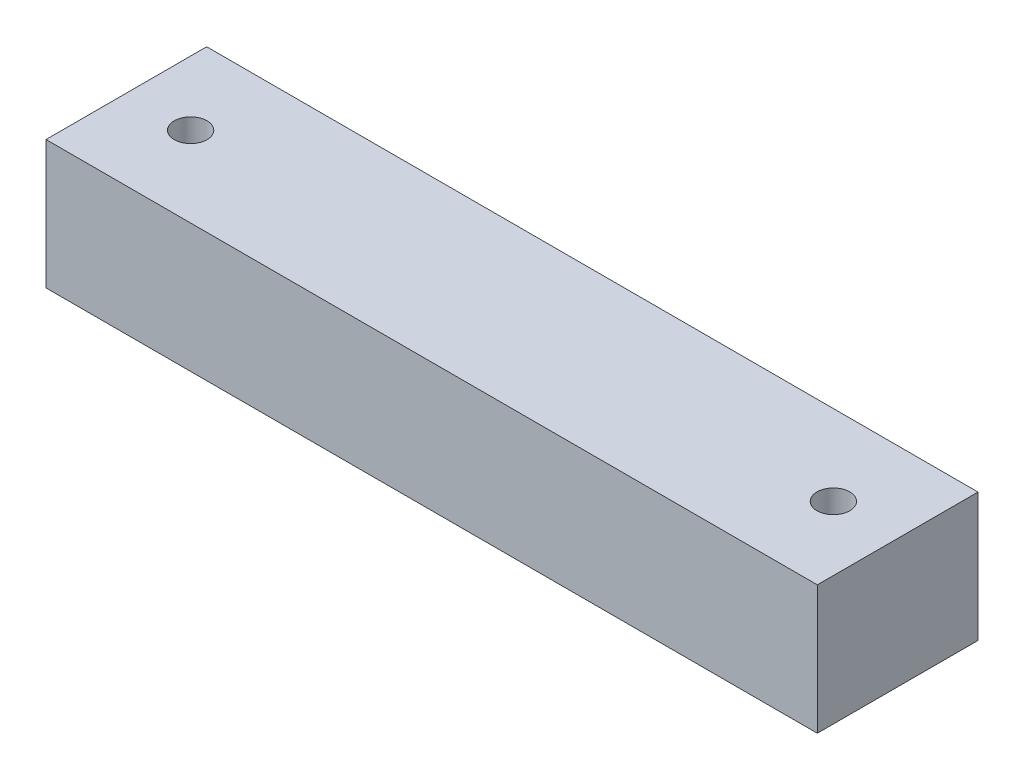
ISO-10303-21;
HEADER;
FILE_DESCRIPTION(('STEP AP214'),'2;1');
FILE_NAME('part.step','',(''),(''),'','','');
FILE_SCHEMA(('AUTOMOTIVE_DESIGN { 1 0 10303 214 1 1 1 1 }'));
ENDSEC;
DATA;
#1=APPLICATION_CONTEXT('core data for automotive mechanical design processes');
#2=APPLICATION_PROTOCOL_DEFINITION('international standard','automotive_design',2000,#1);
#3=PRODUCT_CONTEXT('',#1,'mechanical');
#4=PRODUCT('Part','Part','',(#3));
#5=PRODUCT_RELATED_PRODUCT_CATEGORY('part','',(#4));
#6=PRODUCT_DEFINITION_FORMATION('','',#4);
#7=PRODUCT_DEFINITION_CONTEXT('part definition',#1,'design');
#8=PRODUCT_DEFINITION('design','',#6,#7);
#9=PRODUCT_DEFINITION_SHAPE('','',#8);
#10=(LENGTH_UNIT() NAMED_UNIT(*) SI_UNIT(.MILLI.,.METRE.));
#11=(NAMED_UNIT(*) PLANE_ANGLE_UNIT() SI_UNIT($,.RADIAN.));
#12=(NAMED_UNIT(*) SI_UNIT($,.STERADIAN.) SOLID_ANGLE_UNIT());
#13=UNCERTAINTY_MEASURE_WITH_UNIT(LENGTH_MEASURE(1.E-05),#10,'distance_accuracy_value','');
#14=(GEOMETRIC_REPRESENTATION_CONTEXT(3) GLOBAL_UNCERTAINTY_ASSIGNED_CONTEXT((#13)) GLOBAL_UNIT_ASSIGNED_CONTEXT((#10,
#11,#12)) REPRESENTATION_CONTEXT('',''));
#15=CARTESIAN_POINT('',(0.,0.,0.));
#16=DIRECTION('',(0.,0.,1.));
#17=DIRECTION('',(1.,0.,0.));
#18=AXIS2_PLACEMENT_3D('',#15,#16,#17);
#19=CARTESIAN_POINT('',(0.,40.,0.));
#20=DIRECTION('',(1.,0.,0.));
#21=DIRECTION('',(0.,0.,-1.));
#22=AXIS2_PLACEMENT_3D('',#19,#20,#21);
#23=PLANE('',#22);
#24=DIRECTION('',(0.,0.,1.));
#25=VECTOR('',#24,1.);
#26=CARTESIAN_POINT('',(0.,0.,0.));
#27=LINE('',#26,#25);
#28=CARTESIAN_POINT('',(0.,0.,0.));
#29=VERTEX_POINT('',#28);
#30=CARTESIAN_POINT('',(0.,0.,50.));
#31=VERTEX_POINT('',#30);
#32=EDGE_CURVE('E139',#29,#31,#27,.T.);
#33=ORIENTED_EDGE('',*,*,#32,.T.);
#34=DIRECTION('',(0.,-1.,0.));
#35=VECTOR('',#34,1.);
#36=CARTESIAN_POINT('',(0.,40.,50.));
#37=LINE('',#36,#35);
#38=CARTESIAN_POINT('',(0.,40.,50.));
#39=VERTEX_POINT('',#38);
#40=EDGE_CURVE('E13',#39,#31,#37,.T.);
#41=ORIENTED_EDGE('',*,*,#40,.F.);
#42=DIRECTION('',(0.,0.,1.));
#43=VECTOR('',#42,1.);
#44=CARTESIAN_POINT('',(0.,40.,0.));
#45=LINE('',#44,#43);
#46=CARTESIAN_POINT('',(0.,40.,0.));
#47=VERTEX_POINT('',#46);
#48=EDGE_CURVE('E140',#47,#39,#45,.T.);
#49=ORIENTED_EDGE('',*,*,#48,.F.);
#50=DIRECTION('',(0.,-1.,0.));
#51=VECTOR('',#50,1.);
#52=CARTESIAN_POINT('',(0.,40.,0.));
#53=LINE('',#52,#51);
#54=EDGE_CURVE('E150',#47,#29,#53,.T.);
#55=ORIENTED_EDGE('',*,*,#54,.T.);
#56=EDGE_LOOP('',(#33,#41,#49,#55));
#57=FACE_BOUND('',#56,.T.);
#58=ADVANCED_FACE('F58',(#57),#23,.F.);
#59=CARTESIAN_POINT('',(0.,40.,50.));
#60=DIRECTION('',(0.,0.,-1.));
#61=DIRECTION('',(-1.,0.,0.));
#62=AXIS2_PLACEMENT_3D('',#59,#60,#61);
#63=PLANE('',#62);
#64=DIRECTION('',(1.,0.,0.));
#65=VECTOR('',#64,1.);
#66=CARTESIAN_POINT('',(0.,0.,50.));
#67=LINE('',#66,#65);
#68=CARTESIAN_POINT('',(240.,0.,50.));
#69=VERTEX_POINT('',#68);
#70=EDGE_CURVE('E154',#31,#69,#67,.T.);
#71=ORIENTED_EDGE('',*,*,#70,.T.);
#72=DIRECTION('',(0.,-1.,0.));
#73=VECTOR('',#72,1.);
#74=CARTESIAN_POINT('',(240.,40.,50.));
#75=LINE('',#74,#73);
#76=CARTESIAN_POINT('',(240.,40.,50.));
#77=VERTEX_POINT('',#76);
#78=EDGE_CURVE('E67',#77,#69,#75,.T.);
#79=ORIENTED_EDGE('',*,*,#78,.F.);
#80=DIRECTION('',(1.,0.,0.));
#81=VECTOR('',#80,1.);
#82=CARTESIAN_POINT('',(0.,40.,50.));
#83=LINE('',#82,#81);
#84=EDGE_CURVE('E106',#39,#77,#83,.T.);
#85=ORIENTED_EDGE('',*,*,#84,.F.);
#86=ORIENTED_EDGE('',*,*,#40,.T.);
#87=EDGE_LOOP('',(#71,#79,#85,#86));
#88=FACE_BOUND('',#87,.T.);
#89=ADVANCED_FACE('F185',(#88),#63,.F.);
#90=CARTESIAN_POINT('',(240.,40.,0.));
#91=DIRECTION('',(-1.,0.,0.));
#92=DIRECTION('',(0.,0.,1.));
#93=AXIS2_PLACEMENT_3D('',#90,#91,#92);
#94=PLANE('',#93);
#95=DIRECTION('',(0.,0.,-1.));
#96=VECTOR('',#95,1.);
#97=CARTESIAN_POINT('',(240.,0.,0.));
#98=LINE('',#97,#96);
#99=CARTESIAN_POINT('',(240.,0.,0.));
#100=VERTEX_POINT('',#99);
#101=EDGE_CURVE('E93',#69,#100,#98,.T.);
#102=ORIENTED_EDGE('',*,*,#101,.T.);
#103=DIRECTION('',(0.,-1.,0.));
#104=VECTOR('',#103,1.);
#105=CARTESIAN_POINT('',(240.,40.,0.));
#106=LINE('',#105,#104);
#107=CARTESIAN_POINT('',(240.,40.,0.));
#108=VERTEX_POINT('',#107);
#109=EDGE_CURVE('E163',#108,#100,#106,.T.);
#110=ORIENTED_EDGE('',*,*,#109,.F.);
#111=DIRECTION('',(0.,0.,-1.));
#112=VECTOR('',#111,1.);
#113=CARTESIAN_POINT('',(240.,40.,0.));
#114=LINE('',#113,#112);
#115=EDGE_CURVE('E145',#77,#108,#114,.T.);
#116=ORIENTED_EDGE('',*,*,#115,.F.);
#117=ORIENTED_EDGE('',*,*,#78,.T.);
#118=EDGE_LOOP('',(#102,#110,#116,#117));
#119=FACE_BOUND('',#118,.T.);
#120=ADVANCED_FACE('F168',(#119),#94,.F.);
#121=CARTESIAN_POINT('',(0.,40.,0.));
#122=DIRECTION('',(0.,0.,1.));
#123=DIRECTION('',(1.,0.,0.));
#124=AXIS2_PLACEMENT_3D('',#121,#122,#123);
#125=PLANE('',#124);
#126=DIRECTION('',(-1.,0.,0.));
#127=VECTOR('',#126,1.);
#128=CARTESIAN_POINT('',(0.,0.,0.));
#129=LINE('',#128,#127);
#130=EDGE_CURVE('E99',#100,#29,#129,.T.);
#131=ORIENTED_EDGE('',*,*,#130,.T.);
#132=ORIENTED_EDGE('',*,*,#54,.F.);
#133=DIRECTION('',(-1.,0.,0.));
#134=VECTOR('',#133,1.);
#135=CARTESIAN_POINT('',(0.,40.,0.));
#136=LINE('',#135,#134);
#137=EDGE_CURVE('E75',#108,#47,#136,.T.);
#138=ORIENTED_EDGE('',*,*,#137,.F.);
#139=ORIENTED_EDGE('',*,*,#109,.T.);
#140=EDGE_LOOP('',(#131,#132,#138,#139));
#141=FACE_BOUND('',#140,.T.);
#142=ADVANCED_FACE('F175',(#141),#125,.F.);
#143=CARTESIAN_POINT('',(0.,40.,0.));
#144=DIRECTION('',(0.,1.,0.));
#145=DIRECTION('',(0.,0.,1.));
#146=AXIS2_PLACEMENT_3D('',#143,#144,#145);
#147=PLANE('',#146);
#148=CARTESIAN_POINT('',(20.,40.,25.));
#149=DIRECTION('',(0.,1.,0.));
#150=DIRECTION('',(0.,0.,1.));
#151=AXIS2_PLACEMENT_3D('',#148,#149,#150);
#152=CIRCLE('',#151,5.09999999999999);
#153=CARTESIAN_POINT('',(20.,40.,30.1));
#154=VERTEX_POINT('',#153);
#155=EDGE_CURVE('E125',#154,#154,#152,.T.);
#156=ORIENTED_EDGE('',*,*,#155,.F.);
#157=EDGE_LOOP('',(#156));
#158=FACE_BOUND('',#157,.T.);
#159=CARTESIAN_POINT('',(220.,40.,25.));
#160=DIRECTION('',(0.,1.,0.));
#161=DIRECTION('',(0.,0.,1.));
#162=AXIS2_PLACEMENT_3D('',#159,#160,#161);
#163=CIRCLE('',#162,5.09999999999999);
#164=CARTESIAN_POINT('',(220.,40.,30.1));
#165=VERTEX_POINT('',#164);
#166=EDGE_CURVE('E124',#165,#165,#163,.T.);
#167=ORIENTED_EDGE('',*,*,#166,.F.);
#168=EDGE_LOOP('',(#167));
#169=FACE_BOUND('',#168,.T.);
#170=ORIENTED_EDGE('',*,*,#48,.T.);
#171=ORIENTED_EDGE('',*,*,#84,.T.);
#172=ORIENTED_EDGE('',*,*,#115,.T.);
#173=ORIENTED_EDGE('',*,*,#137,.T.);
#174=EDGE_LOOP('',(#170,#171,#172,#173));
#175=FACE_BOUND('',#174,.T.);
#176=ADVANCED_FACE('F177',(#158,#169,#175),#147,.T.);
#177=CARTESIAN_POINT('',(0.,0.,0.));
#178=DIRECTION('',(0.,1.,0.));
#179=DIRECTION('',(0.,0.,1.));
#180=AXIS2_PLACEMENT_3D('',#177,#178,#179);
#181=PLANE('',#180);
#182=ORIENTED_EDGE('',*,*,#32,.F.);
#183=ORIENTED_EDGE('',*,*,#130,.F.);
#184=ORIENTED_EDGE('',*,*,#101,.F.);
#185=ORIENTED_EDGE('',*,*,#70,.F.);
#186=EDGE_LOOP('',(#182,#183,#184,#185));
#187=FACE_BOUND('',#186,.T.);
#188=ADVANCED_FACE('F171',(#187),#181,.F.);
#189=CARTESIAN_POINT('',(220.,20.,25.));
#190=DIRECTION('',(0.,1.,0.));
#191=DIRECTION('',(0.,0.,1.));
#192=AXIS2_PLACEMENT_3D('',#189,#190,#191);
#193=CONICAL_SURFACE('',#192,5.09999999999999,1.02974425867665);
#194=CARTESIAN_POINT('',(220.,16.9356108429594,25.));
#195=VERTEX_POINT('',#194);
#196=VERTEX_LOOP('',#195);
#197=FACE_BOUND('',#196,.T.);
#198=CARTESIAN_POINT('',(220.,20.,25.));
#199=DIRECTION('',(0.,1.,0.));
#200=DIRECTION('',(0.,0.,1.));
#201=AXIS2_PLACEMENT_3D('',#198,#199,#200);
#202=CIRCLE('',#201,5.09999999999999);
#203=CARTESIAN_POINT('',(220.,20.,30.1));
#204=VERTEX_POINT('',#203);
#205=EDGE_CURVE('E131',#204,#204,#202,.T.);
#206=ORIENTED_EDGE('',*,*,#205,.T.);
#207=EDGE_LOOP('',(#206));
#208=FACE_BOUND('',#207,.T.);
#209=ADVANCED_FACE('F217',(#197,#208),#193,.F.);
#210=CARTESIAN_POINT('',(220.,40.,25.));
#211=DIRECTION('',(0.,1.,0.));
#212=DIRECTION('',(0.,0.,1.));
#213=AXIS2_PLACEMENT_3D('',#210,#211,#212);
#214=CYLINDRICAL_SURFACE('',#213,5.09999999999999);
#215=ORIENTED_EDGE('',*,*,#205,.F.);
#216=EDGE_LOOP('',(#215));
#217=FACE_BOUND('',#216,.T.);
#218=ORIENTED_EDGE('',*,*,#166,.T.);
#219=EDGE_LOOP('',(#218));
#220=FACE_BOUND('',#219,.T.);
#221=ADVANCED_FACE('F117',(#217,#220),#214,.F.);
#222=CARTESIAN_POINT('',(20.,20.,25.));
#223=DIRECTION('',(0.,1.,0.));
#224=DIRECTION('',(0.,0.,1.));
#225=AXIS2_PLACEMENT_3D('',#222,#223,#224);
#226=CONICAL_SURFACE('',#225,5.09999999999999,1.02974425867665);
#227=CARTESIAN_POINT('',(20.,16.9356108429594,25.));
#228=VERTEX_POINT('',#227);
#229=VERTEX_LOOP('',#228);
#230=FACE_BOUND('',#229,.T.);
#231=CARTESIAN_POINT('',(20.,20.,25.));
#232=DIRECTION('',(0.,1.,0.));
#233=DIRECTION('',(0.,0.,1.));
#234=AXIS2_PLACEMENT_3D('',#231,#232,#233);
#235=CIRCLE('',#234,5.09999999999999);
#236=CARTESIAN_POINT('',(20.,20.,30.1));
#237=VERTEX_POINT('',#236);
#238=EDGE_CURVE('E121',#237,#237,#235,.T.);
#239=ORIENTED_EDGE('',*,*,#238,.T.);
#240=EDGE_LOOP('',(#239));
#241=FACE_BOUND('',#240,.T.);
#242=ADVANCED_FACE('F113',(#230,#241),#226,.F.);
#243=CARTESIAN_POINT('',(20.,40.,25.));
#244=DIRECTION('',(0.,1.,0.));
#245=DIRECTION('',(0.,0.,1.));
#246=AXIS2_PLACEMENT_3D('',#243,#244,#245);
#247=CYLINDRICAL_SURFACE('',#246,5.09999999999999);
#248=ORIENTED_EDGE('',*,*,#238,.F.);
#249=EDGE_LOOP('',(#248));
#250=FACE_BOUND('',#249,.T.);
#251=ORIENTED_EDGE('',*,*,#155,.T.);
#252=EDGE_LOOP('',(#251));
#253=FACE_BOUND('',#252,.T.);
#254=ADVANCED_FACE('F116',(#250,#253),#247,.F.);
#255=CLOSED_SHELL('',(#58,#89,#120,#142,#176,#188,#209,#221,#242,#254));
#256=MANIFOLD_SOLID_BREP('B2',#255);
#257=ADVANCED_BREP_SHAPE_REPRESENTATION('',(#18,#256),#14);
#258=SHAPE_DEFINITION_REPRESENTATION(#9,#257);
ENDSEC;
END-ISO-10303-21;
